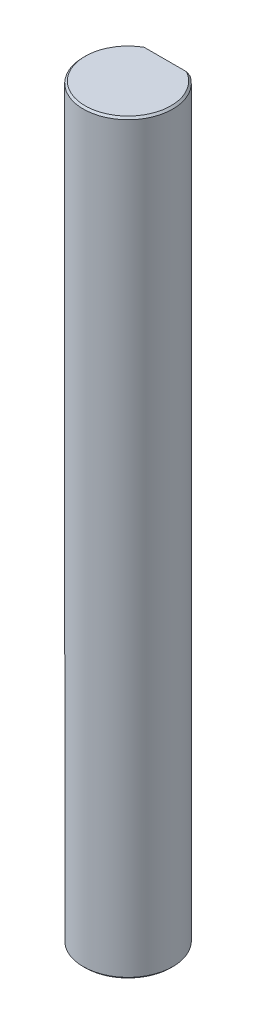
ISO-10303-21;
HEADER;
FILE_DESCRIPTION(('STEP AP214'),'2;1');
FILE_NAME('part.step','',(''),(''),'','','');
FILE_SCHEMA(('AUTOMOTIVE_DESIGN { 1 0 10303 214 1 1 1 1 }'));
ENDSEC;
DATA;
#1=APPLICATION_CONTEXT('core data for automotive mechanical design processes');
#2=APPLICATION_PROTOCOL_DEFINITION('international standard','automotive_design',2000,#1);
#3=PRODUCT_CONTEXT('',#1,'mechanical');
#4=PRODUCT('Part','Part','',(#3));
#5=PRODUCT_RELATED_PRODUCT_CATEGORY('part','',(#4));
#6=PRODUCT_DEFINITION_FORMATION('','',#4);
#7=PRODUCT_DEFINITION_CONTEXT('part definition',#1,'design');
#8=PRODUCT_DEFINITION('design','',#6,#7);
#9=PRODUCT_DEFINITION_SHAPE('','',#8);
#10=(LENGTH_UNIT() NAMED_UNIT(*) SI_UNIT(.MILLI.,.METRE.));
#11=(NAMED_UNIT(*) PLANE_ANGLE_UNIT() SI_UNIT($,.RADIAN.));
#12=(NAMED_UNIT(*) SI_UNIT($,.STERADIAN.) SOLID_ANGLE_UNIT());
#13=UNCERTAINTY_MEASURE_WITH_UNIT(LENGTH_MEASURE(1.E-05),#10,'distance_accuracy_value','');
#14=(GEOMETRIC_REPRESENTATION_CONTEXT(3) GLOBAL_UNCERTAINTY_ASSIGNED_CONTEXT((#13)) GLOBAL_UNIT_ASSIGNED_CONTEXT((#10,
#11,#12)) REPRESENTATION_CONTEXT('',''));
#15=CARTESIAN_POINT('',(0.,0.,0.));
#16=DIRECTION('',(0.,0.,1.));
#17=DIRECTION('',(1.,0.,0.));
#18=AXIS2_PLACEMENT_3D('',#15,#16,#17);
#19=CARTESIAN_POINT('',(0.,50.,0.));
#20=DIRECTION('',(0.,-1.,0.));
#21=DIRECTION('',(0.,0.,-1.));
#22=AXIS2_PLACEMENT_3D('',#19,#20,#21);
#23=CONICAL_SURFACE('',#22,2.875,0.78539816339744);
#24=CARTESIAN_POINT('',(-1.6583123951777,49.875,-2.5));
#25=CARTESIAN_POINT('',(-1.57973572193476,49.9184348904035,-2.5));
#26=CARTESIAN_POINT('',(-1.5002290003424,49.9602466964647,-2.5));
#27=CARTESIAN_POINT('',(-1.41972708645007,50.,-2.5));
#28=(BOUNDED_CURVE() B_SPLINE_CURVE(3,(#24,#25,#26,#27),.UNSPECIFIED.,.F.,
.F.) B_SPLINE_CURVE_WITH_KNOTS((4,4),(0.,0.000269347265701096),
.UNSPECIFIED.) CURVE() GEOMETRIC_REPRESENTATION_ITEM() RATIONAL_B_SPLINE_CURVE((1.,1.,1.,1.)) REPRESENTATION_ITEM(''));
#29=CARTESIAN_POINT('',(-1.6583123951777,49.875,-2.5));
#30=VERTEX_POINT('',#29);
#31=CARTESIAN_POINT('',(-1.41972708645007,50.,-2.5));
#32=VERTEX_POINT('',#31);
#33=EDGE_CURVE('E89',#30,#32,#28,.T.);
#34=ORIENTED_EDGE('',*,*,#33,.F.);
#35=CARTESIAN_POINT('',(0.,49.875,0.));
#36=DIRECTION('',(0.,-1.,0.));
#37=DIRECTION('',(0.,0.,1.));
#38=AXIS2_PLACEMENT_3D('',#35,#36,#37);
#39=CIRCLE('',#38,3.);
#40=CARTESIAN_POINT('',(1.6583123951777,49.875,-2.5));
#41=VERTEX_POINT('',#40);
#42=EDGE_CURVE('E96',#41,#30,#39,.T.);
#43=ORIENTED_EDGE('',*,*,#42,.F.);
#44=CARTESIAN_POINT('',(1.41972708645007,50.,-2.5));
#45=CARTESIAN_POINT('',(1.50022900034239,49.9602466964647,-2.5));
#46=CARTESIAN_POINT('',(1.57973572193477,49.9184348904036,-2.5));
#47=CARTESIAN_POINT('',(1.6583123951777,49.875,-2.5));
#48=(BOUNDED_CURVE() B_SPLINE_CURVE(3,(#44,#45,#46,#47),.UNSPECIFIED.,.F.,
.F.) B_SPLINE_CURVE_WITH_KNOTS((4,4),(0.,0.000269347265701097),
.UNSPECIFIED.) CURVE() GEOMETRIC_REPRESENTATION_ITEM() RATIONAL_B_SPLINE_CURVE((1.,1.,1.,1.)) REPRESENTATION_ITEM(''));
#49=CARTESIAN_POINT('',(1.41972708645007,50.,-2.5));
#50=VERTEX_POINT('',#49);
#51=EDGE_CURVE('E122',#50,#41,#48,.T.);
#52=ORIENTED_EDGE('',*,*,#51,.F.);
#53=CARTESIAN_POINT('',(0.,50.,0.));
#54=DIRECTION('',(0.,1.,0.));
#55=DIRECTION('',(0.,0.,1.));
#56=AXIS2_PLACEMENT_3D('',#53,#54,#55);
#57=CIRCLE('',#56,2.875);
#58=EDGE_CURVE('E19',#32,#50,#57,.T.);
#59=ORIENTED_EDGE('',*,*,#58,.F.);
#60=EDGE_LOOP('',(#34,#43,#52,#59));
#61=FACE_BOUND('',#60,.T.);
#62=ADVANCED_FACE('F16',(#61),#23,.T.);
#63=CARTESIAN_POINT('',(0.,0.124999999999993,0.));
#64=DIRECTION('',(0.,1.,0.));
#65=DIRECTION('',(0.,0.,1.));
#66=AXIS2_PLACEMENT_3D('',#63,#64,#65);
#67=CONICAL_SURFACE('',#66,3.,0.785398163397438);
#68=DIRECTION('',(0.,0.707106781186555,0.70710678118654));
#69=VECTOR('',#68,1.);
#70=CARTESIAN_POINT('',(0.,0.124999999999993,3.));
#71=LINE('',#70,#69);
#72=CARTESIAN_POINT('',(0.,0.,2.875));
#73=VERTEX_POINT('',#72);
#74=CARTESIAN_POINT('',(0.,0.124999999999993,3.));
#75=VERTEX_POINT('',#74);
#76=EDGE_CURVE('E78',#73,#75,#71,.T.);
#77=ORIENTED_EDGE('',*,*,#76,.F.);
#78=CARTESIAN_POINT('',(0.,0.,0.));
#79=DIRECTION('',(0.,-1.,0.));
#80=DIRECTION('',(0.,0.,1.));
#81=AXIS2_PLACEMENT_3D('',#78,#79,#80);
#82=CIRCLE('',#81,2.875);
#83=CARTESIAN_POINT('',(1.41972708645009,0.,-2.5));
#84=VERTEX_POINT('',#83);
#85=EDGE_CURVE('E10',#84,#73,#82,.T.);
#86=ORIENTED_EDGE('',*,*,#85,.F.);
#87=CARTESIAN_POINT('',(1.6583123951777,0.124999999999993,-2.5));
#88=CARTESIAN_POINT('',(1.57973572193476,0.0815651095964618,-2.5));
#89=CARTESIAN_POINT('',(1.50022900034241,0.0397533035352747,-2.5));
#90=CARTESIAN_POINT('',(1.41972708645009,0.,-2.5));
#91=(BOUNDED_CURVE() B_SPLINE_CURVE(3,(#87,#88,#89,#90),.UNSPECIFIED.,.F.,
.F.) B_SPLINE_CURVE_WITH_KNOTS((4,4),(0.,0.00026934726570108),
.UNSPECIFIED.) CURVE() GEOMETRIC_REPRESENTATION_ITEM() RATIONAL_B_SPLINE_CURVE((1.,1.,1.,1.)) REPRESENTATION_ITEM(''));
#92=CARTESIAN_POINT('',(1.6583123951777,0.124999999999993,-2.5));
#93=VERTEX_POINT('',#92);
#94=EDGE_CURVE('E75',#93,#84,#91,.T.);
#95=ORIENTED_EDGE('',*,*,#94,.F.);
#96=CARTESIAN_POINT('',(0.,0.124999999999993,0.));
#97=DIRECTION('',(0.,1.,0.));
#98=DIRECTION('',(0.,0.,1.));
#99=AXIS2_PLACEMENT_3D('',#96,#97,#98);
#100=CIRCLE('',#99,3.);
#101=EDGE_CURVE('E315',#75,#93,#100,.T.);
#102=ORIENTED_EDGE('',*,*,#101,.F.);
#103=EDGE_LOOP('',(#77,#86,#95,#102));
#104=FACE_BOUND('',#103,.T.);
#105=ADVANCED_FACE('F73',(#104),#67,.T.);
#106=CARTESIAN_POINT('',(0.,0.,0.));
#107=DIRECTION('',(0.,1.,0.));
#108=DIRECTION('',(1.,0.,0.));
#109=AXIS2_PLACEMENT_3D('',#106,#107,#108);
#110=PLANE('',#109);
#111=DIRECTION('',(1.,0.,0.));
#112=VECTOR('',#111,1.);
#113=CARTESIAN_POINT('',(0.,0.,-2.5));
#114=LINE('',#113,#112);
#115=CARTESIAN_POINT('',(-1.41972708645009,0.,-2.5));
#116=VERTEX_POINT('',#115);
#117=EDGE_CURVE('E82',#116,#84,#114,.T.);
#118=ORIENTED_EDGE('',*,*,#117,.T.);
#119=ORIENTED_EDGE('',*,*,#85,.T.);
#120=CARTESIAN_POINT('',(0.,0.,0.));
#121=DIRECTION('',(0.,-1.,0.));
#122=DIRECTION('',(0.,0.,1.));
#123=AXIS2_PLACEMENT_3D('',#120,#121,#122);
#124=CIRCLE('',#123,2.875);
#125=EDGE_CURVE('E84',#73,#116,#124,.T.);
#126=ORIENTED_EDGE('',*,*,#125,.T.);
#127=EDGE_LOOP('',(#118,#119,#126));
#128=FACE_BOUND('',#127,.T.);
#129=ADVANCED_FACE('F83',(#128),#110,.F.);
#130=CARTESIAN_POINT('',(0.,50.,0.));
#131=DIRECTION('',(0.,1.,0.));
#132=DIRECTION('',(1.,0.,0.));
#133=AXIS2_PLACEMENT_3D('',#130,#131,#132);
#134=PLANE('',#133);
#135=DIRECTION('',(1.,0.,0.));
#136=VECTOR('',#135,1.);
#137=CARTESIAN_POINT('',(0.,50.,-2.5));
#138=LINE('',#137,#136);
#139=EDGE_CURVE('E115',#32,#50,#138,.T.);
#140=ORIENTED_EDGE('',*,*,#139,.F.);
#141=ORIENTED_EDGE('',*,*,#58,.T.);
#142=EDGE_LOOP('',(#140,#141));
#143=FACE_BOUND('',#142,.T.);
#144=ADVANCED_FACE('F170',(#143),#134,.T.);
#145=CARTESIAN_POINT('',(0.,50.,-2.5));
#146=DIRECTION('',(0.,0.,-1.));
#147=DIRECTION('',(0.,-1.,0.));
#148=AXIS2_PLACEMENT_3D('',#145,#146,#147);
#149=PLANE('',#148);
#150=DIRECTION('',(0.,-1.,0.));
#151=VECTOR('',#150,1.);
#152=CARTESIAN_POINT('',(1.6583123951777,50.,-2.5));
#153=LINE('',#152,#151);
#154=EDGE_CURVE('E93',#41,#93,#153,.T.);
#155=ORIENTED_EDGE('',*,*,#154,.T.);
#156=ORIENTED_EDGE('',*,*,#94,.T.);
#157=ORIENTED_EDGE('',*,*,#117,.F.);
#158=CARTESIAN_POINT('',(-1.41972708645009,0.,-2.5));
#159=CARTESIAN_POINT('',(-1.5002290003424,0.0397533035352989,-2.5));
#160=CARTESIAN_POINT('',(-1.57973572193477,0.0815651095964495,-2.5));
#161=CARTESIAN_POINT('',(-1.6583123951777,0.124999999999993,-2.5));
#162=(BOUNDED_CURVE() B_SPLINE_CURVE(3,(#158,#159,#160,#161),.UNSPECIFIED.,.F.,
.F.) B_SPLINE_CURVE_WITH_KNOTS((4,4),(0.,0.000269347265701079),
.UNSPECIFIED.) CURVE() GEOMETRIC_REPRESENTATION_ITEM() RATIONAL_B_SPLINE_CURVE((1.,1.,1.,1.)) REPRESENTATION_ITEM(''));
#163=CARTESIAN_POINT('',(-1.6583123951777,0.124999999999993,-2.5));
#164=VERTEX_POINT('',#163);
#165=EDGE_CURVE('E312',#116,#164,#162,.T.);
#166=ORIENTED_EDGE('',*,*,#165,.T.);
#167=DIRECTION('',(0.,-1.,0.));
#168=VECTOR('',#167,1.);
#169=CARTESIAN_POINT('',(-1.6583123951777,50.,-2.5));
#170=LINE('',#169,#168);
#171=EDGE_CURVE('E311',#30,#164,#170,.T.);
#172=ORIENTED_EDGE('',*,*,#171,.F.);
#173=ORIENTED_EDGE('',*,*,#33,.T.);
#174=ORIENTED_EDGE('',*,*,#139,.T.);
#175=ORIENTED_EDGE('',*,*,#51,.T.);
#176=EDGE_LOOP('',(#155,#156,#157,#166,#172,#173,#174,#175));
#177=FACE_BOUND('',#176,.T.);
#178=ADVANCED_FACE('F91',(#177),#149,.T.);
#179=CARTESIAN_POINT('',(0.,50.,0.));
#180=DIRECTION('',(0.,-1.,0.));
#181=DIRECTION('',(0.,0.,-1.));
#182=AXIS2_PLACEMENT_3D('',#179,#180,#181);
#183=CYLINDRICAL_SURFACE('',#182,3.);
#184=ORIENTED_EDGE('',*,*,#171,.T.);
#185=CARTESIAN_POINT('',(0.,0.124999999999993,0.));
#186=DIRECTION('',(0.,1.,0.));
#187=DIRECTION('',(0.,0.,1.));
#188=AXIS2_PLACEMENT_3D('',#185,#186,#187);
#189=CIRCLE('',#188,3.);
#190=EDGE_CURVE('E322',#164,#75,#189,.T.);
#191=ORIENTED_EDGE('',*,*,#190,.T.);
#192=ORIENTED_EDGE('',*,*,#101,.T.);
#193=ORIENTED_EDGE('',*,*,#154,.F.);
#194=ORIENTED_EDGE('',*,*,#42,.T.);
#195=EDGE_LOOP('',(#184,#191,#192,#193,#194));
#196=FACE_BOUND('',#195,.T.);
#197=ADVANCED_FACE('F148',(#196),#183,.T.);
#198=CARTESIAN_POINT('',(0.,0.124999999999993,0.));
#199=DIRECTION('',(0.,1.,0.));
#200=DIRECTION('',(0.,0.,1.));
#201=AXIS2_PLACEMENT_3D('',#198,#199,#200);
#202=CONICAL_SURFACE('',#201,3.,0.785398163397438);
#203=ORIENTED_EDGE('',*,*,#125,.F.);
#204=ORIENTED_EDGE('',*,*,#76,.T.);
#205=ORIENTED_EDGE('',*,*,#190,.F.);
#206=ORIENTED_EDGE('',*,*,#165,.F.);
#207=EDGE_LOOP('',(#203,#204,#205,#206));
#208=FACE_BOUND('',#207,.T.);
#209=ADVANCED_FACE('F143',(#208),#202,.T.);
#210=CLOSED_SHELL('',(#62,#105,#129,#144,#178,#197,#209));
#211=MANIFOLD_SOLID_BREP('B1',#210);
#212=ADVANCED_BREP_SHAPE_REPRESENTATION('',(#18,#211),#14);
#213=SHAPE_DEFINITION_REPRESENTATION(#9,#212);
ENDSEC;
END-ISO-10303-21;
